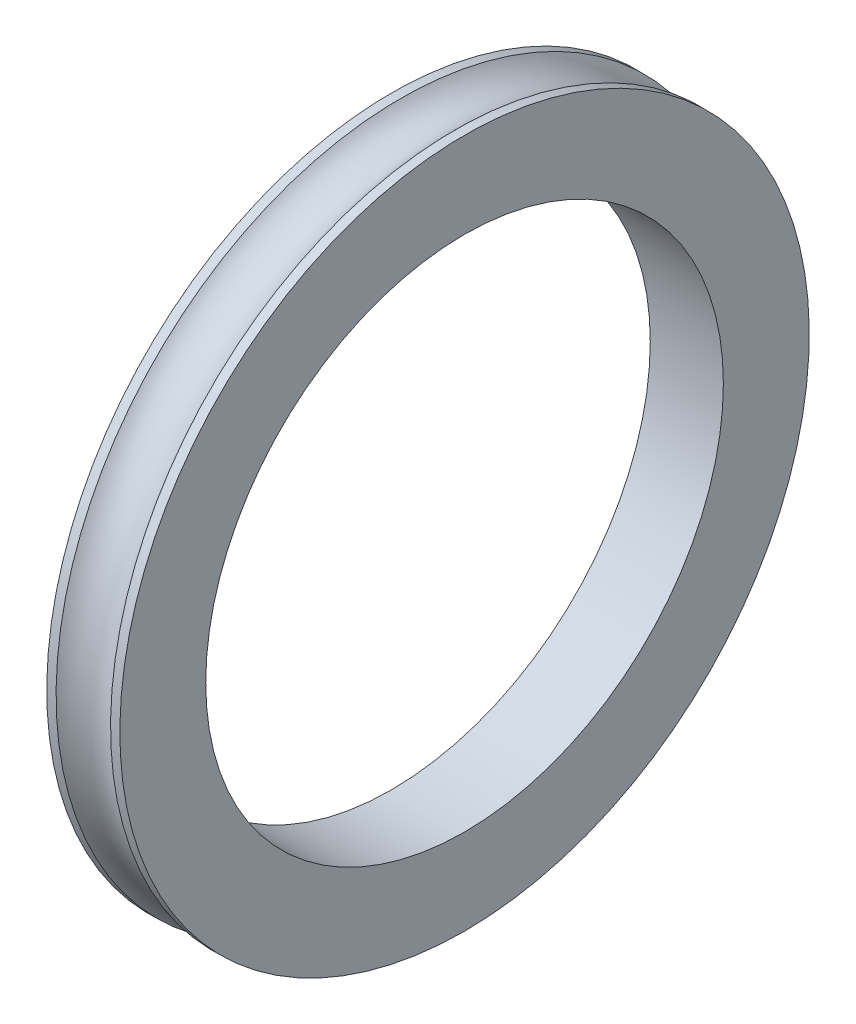
ISO-10303-21;
HEADER;
FILE_DESCRIPTION(('STEP AP214'),'2;1');
FILE_NAME('part.step','',(''),(''),'','','');
FILE_SCHEMA(('AUTOMOTIVE_DESIGN { 1 0 10303 214 1 1 1 1 }'));
ENDSEC;
DATA;
#1=APPLICATION_CONTEXT('core data for automotive mechanical design processes');
#2=APPLICATION_PROTOCOL_DEFINITION('international standard','automotive_design',2000,#1);
#3=PRODUCT_CONTEXT('',#1,'mechanical');
#4=PRODUCT('Part','Part','',(#3));
#5=PRODUCT_RELATED_PRODUCT_CATEGORY('part','',(#4));
#6=PRODUCT_DEFINITION_FORMATION('','',#4);
#7=PRODUCT_DEFINITION_CONTEXT('part definition',#1,'design');
#8=PRODUCT_DEFINITION('design','',#6,#7);
#9=PRODUCT_DEFINITION_SHAPE('','',#8);
#10=(LENGTH_UNIT() NAMED_UNIT(*) SI_UNIT(.MILLI.,.METRE.));
#11=(NAMED_UNIT(*) PLANE_ANGLE_UNIT() SI_UNIT($,.RADIAN.));
#12=(NAMED_UNIT(*) SI_UNIT($,.STERADIAN.) SOLID_ANGLE_UNIT());
#13=UNCERTAINTY_MEASURE_WITH_UNIT(LENGTH_MEASURE(1.E-05),#10,'distance_accuracy_value','');
#14=(GEOMETRIC_REPRESENTATION_CONTEXT(3) GLOBAL_UNCERTAINTY_ASSIGNED_CONTEXT((#13)) GLOBAL_UNIT_ASSIGNED_CONTEXT((#10,
#11,#12)) REPRESENTATION_CONTEXT('',''));
#15=CARTESIAN_POINT('',(0.,0.,0.));
#16=DIRECTION('',(0.,0.,1.));
#17=DIRECTION('',(1.,0.,0.));
#18=AXIS2_PLACEMENT_3D('',#15,#16,#17);
#19=CARTESIAN_POINT('',(-4.44755244755244,0.,0.));
#20=DIRECTION('',(-1.,0.,0.));
#21=DIRECTION('',(0.,-1.,0.));
#22=AXIS2_PLACEMENT_3D('',#19,#20,#21);
#23=CYLINDRICAL_SURFACE('',#22,56.595);
#24=CARTESIAN_POINT('',(-6.,0.,0.));
#25=DIRECTION('',(-1.,0.,0.));
#26=DIRECTION('',(0.,-1.,0.));
#27=AXIS2_PLACEMENT_3D('',#24,#25,#26);
#28=CIRCLE('',#27,56.595);
#29=CARTESIAN_POINT('',(-6.,-56.595,0.));
#30=VERTEX_POINT('',#29);
#31=EDGE_CURVE('E10',#30,#30,#28,.T.);
#32=ORIENTED_EDGE('',*,*,#31,.F.);
#33=EDGE_LOOP('',(#32));
#34=FACE_BOUND('',#33,.T.);
#35=CARTESIAN_POINT('',(-4.47213595499959,0.,0.));
#36=DIRECTION('',(-1.,0.,0.));
#37=DIRECTION('',(0.,-1.,0.));
#38=AXIS2_PLACEMENT_3D('',#35,#36,#37);
#39=CIRCLE('',#38,56.595);
#40=CARTESIAN_POINT('',(-4.47213595499959,-56.595,0.));
#41=VERTEX_POINT('',#40);
#42=EDGE_CURVE('E22',#41,#41,#39,.T.);
#43=ORIENTED_EDGE('',*,*,#42,.T.);
#44=EDGE_LOOP('',(#43));
#45=FACE_BOUND('',#44,.T.);
#46=ADVANCED_FACE('F15',(#34,#45),#23,.T.);
#47=CARTESIAN_POINT('',(-6.,0.,42.495));
#48=DIRECTION('',(1.,0.,0.));
#49=DIRECTION('',(0.,1.,0.));
#50=AXIS2_PLACEMENT_3D('',#47,#48,#49);
#51=PLANE('',#50);
#52=CARTESIAN_POINT('',(-6.,0.,0.));
#53=DIRECTION('',(-1.,0.,0.));
#54=DIRECTION('',(0.,-1.,0.));
#55=AXIS2_PLACEMENT_3D('',#52,#53,#54);
#56=CIRCLE('',#55,42.495);
#57=CARTESIAN_POINT('',(-6.,-42.495,0.));
#58=VERTEX_POINT('',#57);
#59=EDGE_CURVE('E29',#58,#58,#56,.T.);
#60=ORIENTED_EDGE('',*,*,#59,.F.);
#61=EDGE_LOOP('',(#60));
#62=FACE_BOUND('',#61,.T.);
#63=ORIENTED_EDGE('',*,*,#31,.T.);
#64=EDGE_LOOP('',(#63));
#65=FACE_BOUND('',#64,.T.);
#66=ADVANCED_FACE('F69',(#62,#65),#51,.F.);
#67=CARTESIAN_POINT('',(-4.44755244755244,0.,0.));
#68=DIRECTION('',(-1.,0.,0.));
#69=DIRECTION('',(0.,-1.,0.));
#70=AXIS2_PLACEMENT_3D('',#67,#68,#69);
#71=CYLINDRICAL_SURFACE('',#70,42.495);
#72=CARTESIAN_POINT('',(6.,0.,0.));
#73=DIRECTION('',(-1.,0.,0.));
#74=DIRECTION('',(0.,-1.,0.));
#75=AXIS2_PLACEMENT_3D('',#72,#73,#74);
#76=CIRCLE('',#75,42.495);
#77=CARTESIAN_POINT('',(6.,-42.495,0.));
#78=VERTEX_POINT('',#77);
#79=EDGE_CURVE('E35',#78,#78,#76,.T.);
#80=ORIENTED_EDGE('',*,*,#79,.F.);
#81=EDGE_LOOP('',(#80));
#82=FACE_BOUND('',#81,.T.);
#83=ORIENTED_EDGE('',*,*,#59,.T.);
#84=EDGE_LOOP('',(#83));
#85=FACE_BOUND('',#84,.T.);
#86=ADVANCED_FACE('F63',(#82,#85),#71,.F.);
#87=CARTESIAN_POINT('',(6.,0.,42.495));
#88=DIRECTION('',(-1.,0.,0.));
#89=DIRECTION('',(0.,-1.,0.));
#90=AXIS2_PLACEMENT_3D('',#87,#88,#89);
#91=PLANE('',#90);
#92=CARTESIAN_POINT('',(6.,0.,0.));
#93=DIRECTION('',(-1.,0.,0.));
#94=DIRECTION('',(0.,-1.,0.));
#95=AXIS2_PLACEMENT_3D('',#92,#93,#94);
#96=CIRCLE('',#95,56.595);
#97=CARTESIAN_POINT('',(6.,-56.595,0.));
#98=VERTEX_POINT('',#97);
#99=EDGE_CURVE('E41',#98,#98,#96,.T.);
#100=ORIENTED_EDGE('',*,*,#99,.F.);
#101=EDGE_LOOP('',(#100));
#102=FACE_BOUND('',#101,.T.);
#103=ORIENTED_EDGE('',*,*,#79,.T.);
#104=EDGE_LOOP('',(#103));
#105=FACE_BOUND('',#104,.T.);
#106=ADVANCED_FACE('F57',(#102,#105),#91,.F.);
#107=CARTESIAN_POINT('',(-4.44755244755244,0.,0.));
#108=DIRECTION('',(-1.,0.,0.));
#109=DIRECTION('',(0.,-1.,0.));
#110=AXIS2_PLACEMENT_3D('',#107,#108,#109);
#111=CYLINDRICAL_SURFACE('',#110,56.595);
#112=CARTESIAN_POINT('',(4.47213595499959,0.,0.));
#113=DIRECTION('',(-1.,0.,0.));
#114=DIRECTION('',(0.,-1.,0.));
#115=AXIS2_PLACEMENT_3D('',#112,#113,#114);
#116=CIRCLE('',#115,56.595);
#117=CARTESIAN_POINT('',(4.47213595499959,-56.595,0.));
#118=VERTEX_POINT('',#117);
#119=EDGE_CURVE('E45',#118,#118,#116,.T.);
#120=ORIENTED_EDGE('',*,*,#119,.F.);
#121=EDGE_LOOP('',(#120));
#122=FACE_BOUND('',#121,.T.);
#123=ORIENTED_EDGE('',*,*,#99,.T.);
#124=EDGE_LOOP('',(#123));
#125=FACE_BOUND('',#124,.T.);
#126=ADVANCED_FACE('F54',(#122,#125),#111,.T.);
#127=CARTESIAN_POINT('',(0.,0.,0.));
#128=DIRECTION('',(-1.,0.,0.));
#129=DIRECTION('',(0.,-1.,0.));
#130=AXIS2_PLACEMENT_3D('',#127,#128,#129);
#131=TOROIDAL_SURFACE('',#130,60.595,6.);
#132=ORIENTED_EDGE('',*,*,#42,.F.);
#133=EDGE_LOOP('',(#132));
#134=FACE_BOUND('',#133,.T.);
#135=ORIENTED_EDGE('',*,*,#119,.T.);
#136=EDGE_LOOP('',(#135));
#137=FACE_BOUND('',#136,.T.);
#138=ADVANCED_FACE('F52',(#134,#137),#131,.F.);
#139=CLOSED_SHELL('',(#46,#66,#86,#106,#126,#138));
#140=MANIFOLD_SOLID_BREP('B1',#139);
#141=ADVANCED_BREP_SHAPE_REPRESENTATION('',(#18,#140),#14);
#142=SHAPE_DEFINITION_REPRESENTATION(#9,#141);
ENDSEC;
END-ISO-10303-21;
